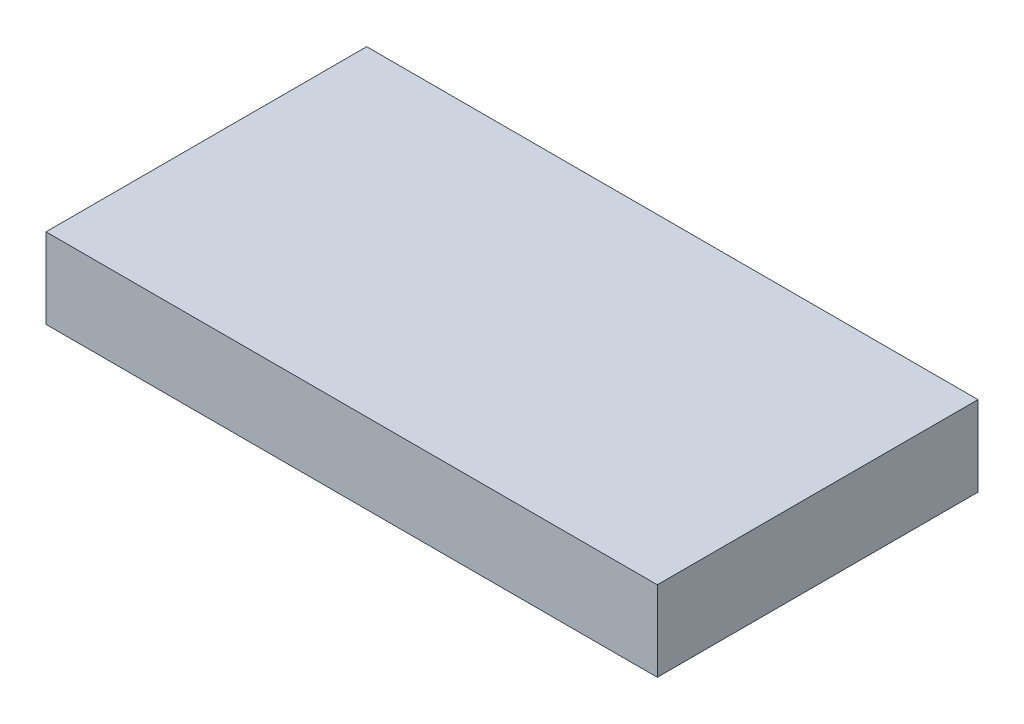
ISO-10303-21;
HEADER;
FILE_DESCRIPTION(('STEP AP214'),'2;1');
FILE_NAME('part.step','',(''),(''),'','','');
FILE_SCHEMA(('AUTOMOTIVE_DESIGN { 1 0 10303 214 1 1 1 1 }'));
ENDSEC;
DATA;
#1=APPLICATION_CONTEXT('core data for automotive mechanical design processes');
#2=APPLICATION_PROTOCOL_DEFINITION('international standard','automotive_design',2000,#1);
#3=PRODUCT_CONTEXT('',#1,'mechanical');
#4=PRODUCT('Part','Part','',(#3));
#5=PRODUCT_RELATED_PRODUCT_CATEGORY('part','',(#4));
#6=PRODUCT_DEFINITION_FORMATION('','',#4);
#7=PRODUCT_DEFINITION_CONTEXT('part definition',#1,'design');
#8=PRODUCT_DEFINITION('design','',#6,#7);
#9=PRODUCT_DEFINITION_SHAPE('','',#8);
#10=(LENGTH_UNIT() NAMED_UNIT(*) SI_UNIT(.MILLI.,.METRE.));
#11=(NAMED_UNIT(*) PLANE_ANGLE_UNIT() SI_UNIT($,.RADIAN.));
#12=(NAMED_UNIT(*) SI_UNIT($,.STERADIAN.) SOLID_ANGLE_UNIT());
#13=UNCERTAINTY_MEASURE_WITH_UNIT(LENGTH_MEASURE(1.E-05),#10,'distance_accuracy_value','');
#14=(GEOMETRIC_REPRESENTATION_CONTEXT(3) GLOBAL_UNCERTAINTY_ASSIGNED_CONTEXT((#13)) GLOBAL_UNIT_ASSIGNED_CONTEXT((#10,
#11,#12)) REPRESENTATION_CONTEXT('',''));
#15=CARTESIAN_POINT('',(0.,0.,0.));
#16=DIRECTION('',(0.,0.,1.));
#17=DIRECTION('',(1.,0.,0.));
#18=AXIS2_PLACEMENT_3D('',#15,#16,#17);
#19=CARTESIAN_POINT('',(96.8375,12.7,-50.8));
#20=DIRECTION('',(-1.,0.,0.));
#21=DIRECTION('',(0.,0.,1.));
#22=AXIS2_PLACEMENT_3D('',#19,#20,#21);
#23=PLANE('',#22);
#24=DIRECTION('',(0.,0.,-1.));
#25=VECTOR('',#24,1.);
#26=CARTESIAN_POINT('',(96.8375,-12.7,-50.8));
#27=LINE('',#26,#25);
#28=CARTESIAN_POINT('',(96.8375,-12.7,50.8));
#29=VERTEX_POINT('',#28);
#30=CARTESIAN_POINT('',(96.8375,-12.7,-50.8));
#31=VERTEX_POINT('',#30);
#32=EDGE_CURVE('E95',#29,#31,#27,.T.);
#33=ORIENTED_EDGE('',*,*,#32,.T.);
#34=DIRECTION('',(0.,-1.,0.));
#35=VECTOR('',#34,1.);
#36=CARTESIAN_POINT('',(96.8375,12.7,-50.8));
#37=LINE('',#36,#35);
#38=CARTESIAN_POINT('',(96.8375,12.7,-50.8));
#39=VERTEX_POINT('',#38);
#40=EDGE_CURVE('E11',#39,#31,#37,.T.);
#41=ORIENTED_EDGE('',*,*,#40,.F.);
#42=DIRECTION('',(0.,0.,-1.));
#43=VECTOR('',#42,1.);
#44=CARTESIAN_POINT('',(96.8375,12.7,-50.8));
#45=LINE('',#44,#43);
#46=CARTESIAN_POINT('',(96.8375,12.7,50.8));
#47=VERTEX_POINT('',#46);
#48=EDGE_CURVE('E83',#47,#39,#45,.T.);
#49=ORIENTED_EDGE('',*,*,#48,.F.);
#50=DIRECTION('',(0.,-1.,0.));
#51=VECTOR('',#50,1.);
#52=CARTESIAN_POINT('',(96.8375,12.7,50.8));
#53=LINE('',#52,#51);
#54=EDGE_CURVE('E91',#47,#29,#53,.T.);
#55=ORIENTED_EDGE('',*,*,#54,.T.);
#56=EDGE_LOOP('',(#33,#41,#49,#55));
#57=FACE_BOUND('',#56,.T.);
#58=ADVANCED_FACE('F32',(#57),#23,.F.);
#59=CARTESIAN_POINT('',(-96.8375,12.7,-50.8));
#60=DIRECTION('',(0.,0.,1.));
#61=DIRECTION('',(1.,0.,0.));
#62=AXIS2_PLACEMENT_3D('',#59,#60,#61);
#63=PLANE('',#62);
#64=DIRECTION('',(-1.,0.,0.));
#65=VECTOR('',#64,1.);
#66=CARTESIAN_POINT('',(-96.8375,-12.7,-50.8));
#67=LINE('',#66,#65);
#68=CARTESIAN_POINT('',(-96.8375,-12.7,-50.8));
#69=VERTEX_POINT('',#68);
#70=EDGE_CURVE('E87',#31,#69,#67,.T.);
#71=ORIENTED_EDGE('',*,*,#70,.T.);
#72=DIRECTION('',(0.,-1.,0.));
#73=VECTOR('',#72,1.);
#74=CARTESIAN_POINT('',(-96.8375,12.7,-50.8));
#75=LINE('',#74,#73);
#76=CARTESIAN_POINT('',(-96.8375,12.7,-50.8));
#77=VERTEX_POINT('',#76);
#78=EDGE_CURVE('E40',#77,#69,#75,.T.);
#79=ORIENTED_EDGE('',*,*,#78,.F.);
#80=DIRECTION('',(-1.,0.,0.));
#81=VECTOR('',#80,1.);
#82=CARTESIAN_POINT('',(-96.8375,12.7,-50.8));
#83=LINE('',#82,#81);
#84=EDGE_CURVE('E78',#39,#77,#83,.T.);
#85=ORIENTED_EDGE('',*,*,#84,.F.);
#86=ORIENTED_EDGE('',*,*,#40,.T.);
#87=EDGE_LOOP('',(#71,#79,#85,#86));
#88=FACE_BOUND('',#87,.T.);
#89=ADVANCED_FACE('F86',(#88),#63,.F.);
#90=CARTESIAN_POINT('',(-96.8375,12.7,-50.8));
#91=DIRECTION('',(1.,0.,0.));
#92=DIRECTION('',(0.,0.,-1.));
#93=AXIS2_PLACEMENT_3D('',#90,#91,#92);
#94=PLANE('',#93);
#95=DIRECTION('',(0.,0.,1.));
#96=VECTOR('',#95,1.);
#97=CARTESIAN_POINT('',(-96.8375,-12.7,-50.8));
#98=LINE('',#97,#96);
#99=CARTESIAN_POINT('',(-96.8375,-12.7,50.8));
#100=VERTEX_POINT('',#99);
#101=EDGE_CURVE('E65',#69,#100,#98,.T.);
#102=ORIENTED_EDGE('',*,*,#101,.T.);
#103=DIRECTION('',(0.,-1.,0.));
#104=VECTOR('',#103,1.);
#105=CARTESIAN_POINT('',(-96.8375,12.7,50.8));
#106=LINE('',#105,#104);
#107=CARTESIAN_POINT('',(-96.8375,12.7,50.8));
#108=VERTEX_POINT('',#107);
#109=EDGE_CURVE('E88',#108,#100,#106,.T.);
#110=ORIENTED_EDGE('',*,*,#109,.F.);
#111=DIRECTION('',(0.,0.,1.));
#112=VECTOR('',#111,1.);
#113=CARTESIAN_POINT('',(-96.8375,12.7,-50.8));
#114=LINE('',#113,#112);
#115=EDGE_CURVE('E81',#77,#108,#114,.T.);
#116=ORIENTED_EDGE('',*,*,#115,.F.);
#117=ORIENTED_EDGE('',*,*,#78,.T.);
#118=EDGE_LOOP('',(#102,#110,#116,#117));
#119=FACE_BOUND('',#118,.T.);
#120=ADVANCED_FACE('F89',(#119),#94,.F.);
#121=CARTESIAN_POINT('',(-96.8375,12.7,50.8));
#122=DIRECTION('',(0.,0.,-1.));
#123=DIRECTION('',(-1.,0.,0.));
#124=AXIS2_PLACEMENT_3D('',#121,#122,#123);
#125=PLANE('',#124);
#126=DIRECTION('',(1.,0.,0.));
#127=VECTOR('',#126,1.);
#128=CARTESIAN_POINT('',(-96.8375,-12.7,50.8));
#129=LINE('',#128,#127);
#130=EDGE_CURVE('E71',#100,#29,#129,.T.);
#131=ORIENTED_EDGE('',*,*,#130,.T.);
#132=ORIENTED_EDGE('',*,*,#54,.F.);
#133=DIRECTION('',(1.,0.,0.));
#134=VECTOR('',#133,1.);
#135=CARTESIAN_POINT('',(-96.8375,12.7,50.8));
#136=LINE('',#135,#134);
#137=EDGE_CURVE('E48',#108,#47,#136,.T.);
#138=ORIENTED_EDGE('',*,*,#137,.F.);
#139=ORIENTED_EDGE('',*,*,#109,.T.);
#140=EDGE_LOOP('',(#131,#132,#138,#139));
#141=FACE_BOUND('',#140,.T.);
#142=ADVANCED_FACE('F102',(#141),#125,.F.);
#143=CARTESIAN_POINT('',(0.,12.7,0.));
#144=DIRECTION('',(0.,1.,0.));
#145=DIRECTION('',(0.,0.,1.));
#146=AXIS2_PLACEMENT_3D('',#143,#144,#145);
#147=PLANE('',#146);
#148=ORIENTED_EDGE('',*,*,#48,.T.);
#149=ORIENTED_EDGE('',*,*,#84,.T.);
#150=ORIENTED_EDGE('',*,*,#115,.T.);
#151=ORIENTED_EDGE('',*,*,#137,.T.);
#152=EDGE_LOOP('',(#148,#149,#150,#151));
#153=FACE_BOUND('',#152,.T.);
#154=ADVANCED_FACE('F79',(#153),#147,.T.);
#155=CARTESIAN_POINT('',(0.,-12.7,0.));
#156=DIRECTION('',(0.,1.,0.));
#157=DIRECTION('',(0.,0.,1.));
#158=AXIS2_PLACEMENT_3D('',#155,#156,#157);
#159=PLANE('',#158);
#160=ORIENTED_EDGE('',*,*,#32,.F.);
#161=ORIENTED_EDGE('',*,*,#130,.F.);
#162=ORIENTED_EDGE('',*,*,#101,.F.);
#163=ORIENTED_EDGE('',*,*,#70,.F.);
#164=EDGE_LOOP('',(#160,#161,#162,#163));
#165=FACE_BOUND('',#164,.T.);
#166=ADVANCED_FACE('F105',(#165),#159,.F.);
#167=CLOSED_SHELL('',(#58,#89,#120,#142,#154,#166));
#168=MANIFOLD_SOLID_BREP('B2',#167);
#169=ADVANCED_BREP_SHAPE_REPRESENTATION('',(#18,#168),#14);
#170=SHAPE_DEFINITION_REPRESENTATION(#9,#169);
ENDSEC;
END-ISO-10303-21;
